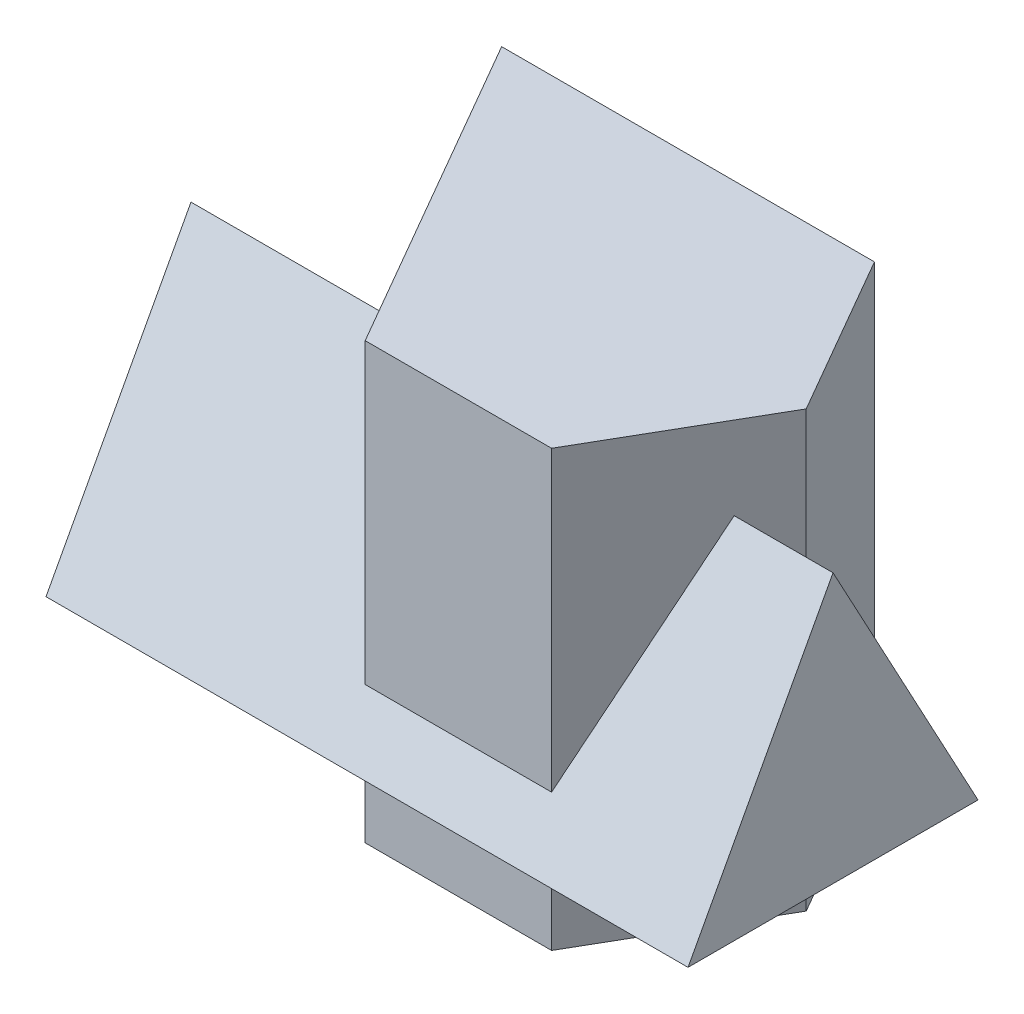
ISO-10303-21;
HEADER;
FILE_DESCRIPTION(('STEP AP214'),'2;1');
FILE_NAME('part.step','',(''),(''),'','','');
FILE_SCHEMA(('AUTOMOTIVE_DESIGN { 1 0 10303 214 1 1 1 1 }'));
ENDSEC;
DATA;
#1=APPLICATION_CONTEXT('core data for automotive mechanical design processes');
#2=APPLICATION_PROTOCOL_DEFINITION('international standard','automotive_design',2000,#1);
#3=PRODUCT_CONTEXT('',#1,'mechanical');
#4=PRODUCT('Part','Part','',(#3));
#5=PRODUCT_RELATED_PRODUCT_CATEGORY('part','',(#4));
#6=PRODUCT_DEFINITION_FORMATION('','',#4);
#7=PRODUCT_DEFINITION_CONTEXT('part definition',#1,'design');
#8=PRODUCT_DEFINITION('design','',#6,#7);
#9=PRODUCT_DEFINITION_SHAPE('','',#8);
#10=(LENGTH_UNIT() NAMED_UNIT(*) SI_UNIT(.MILLI.,.METRE.));
#11=(NAMED_UNIT(*) PLANE_ANGLE_UNIT() SI_UNIT($,.RADIAN.));
#12=(NAMED_UNIT(*) SI_UNIT($,.STERADIAN.) SOLID_ANGLE_UNIT());
#13=UNCERTAINTY_MEASURE_WITH_UNIT(LENGTH_MEASURE(1.E-05),#10,'distance_accuracy_value','');
#14=(GEOMETRIC_REPRESENTATION_CONTEXT(3) GLOBAL_UNCERTAINTY_ASSIGNED_CONTEXT((#13)) GLOBAL_UNIT_ASSIGNED_CONTEXT((#10,
#11,#12)) REPRESENTATION_CONTEXT('',''));
#15=CARTESIAN_POINT('',(0.,0.,0.));
#16=DIRECTION('',(0.,0.,1.));
#17=DIRECTION('',(1.,0.,0.));
#18=AXIS2_PLACEMENT_3D('',#15,#16,#17);
#19=CARTESIAN_POINT('',(-92.5,85.,11.0288568297002));
#20=DIRECTION('',(0.,0.474099823035017,-0.880471099922175));
#21=DIRECTION('',(0.,0.880471099922175,0.474099823035017));
#22=AXIS2_PLACEMENT_3D('',#19,#20,#21);
#23=PLANE('',#22);
#24=DIRECTION('',(0.,0.880471099922175,0.474099823035017));
#25=VECTOR('',#24,1.);
#26=CARTESIAN_POINT('',(62.5,85.,11.0288568297002));
#27=LINE('',#26,#25);
#28=CARTESIAN_POINT('',(62.5,20.,-23.9711431702998));
#29=VERTEX_POINT('',#28);
#30=CARTESIAN_POINT('',(62.5,85.,11.0288568297002));
#31=VERTEX_POINT('',#30);
#32=EDGE_CURVE('E76',#29,#31,#27,.T.);
#33=ORIENTED_EDGE('',*,*,#32,.F.);
#34=DIRECTION('',(1.,0.,0.));
#35=VECTOR('',#34,1.);
#36=CARTESIAN_POINT('',(-92.5,20.,-23.9711431702998));
#37=LINE('',#36,#35);
#38=CARTESIAN_POINT('',(-92.5,20.,-23.9711431702998));
#39=VERTEX_POINT('',#38);
#40=EDGE_CURVE('E12',#39,#29,#37,.T.);
#41=ORIENTED_EDGE('',*,*,#40,.F.);
#42=DIRECTION('',(0.,0.880471099922175,0.474099823035017));
#43=VECTOR('',#42,1.);
#44=CARTESIAN_POINT('',(-92.5,85.,11.0288568297002));
#45=LINE('',#44,#43);
#46=CARTESIAN_POINT('',(-92.5,85.,11.0288568297002));
#47=VERTEX_POINT('',#46);
#48=EDGE_CURVE('E78',#39,#47,#45,.T.);
#49=ORIENTED_EDGE('',*,*,#48,.T.);
#50=DIRECTION('',(1.,0.,0.));
#51=VECTOR('',#50,1.);
#52=CARTESIAN_POINT('',(-92.5,85.,11.0288568297002));
#53=LINE('',#52,#51);
#54=EDGE_CURVE('E45',#47,#31,#53,.T.);
#55=ORIENTED_EDGE('',*,*,#54,.T.);
#56=EDGE_LOOP('',(#33,#41,#49,#55));
#57=FACE_BOUND('',#56,.T.);
#58=ADVANCED_FACE('F42',(#57),#23,.T.);
#59=CARTESIAN_POINT('',(-92.5,20.,46.0288568297002));
#60=DIRECTION('',(0.,-1.,0.));
#61=DIRECTION('',(0.,0.,-1.));
#62=AXIS2_PLACEMENT_3D('',#59,#60,#61);
#63=PLANE('',#62);
#64=DIRECTION('',(0.,0.,-1.));
#65=VECTOR('',#64,1.);
#66=CARTESIAN_POINT('',(62.5,20.,46.0288568297002));
#67=LINE('',#66,#65);
#68=CARTESIAN_POINT('',(62.5,20.,46.0288568297002));
#69=VERTEX_POINT('',#68);
#70=EDGE_CURVE('E86',#69,#29,#67,.T.);
#71=ORIENTED_EDGE('',*,*,#70,.F.);
#72=DIRECTION('',(1.,0.,0.));
#73=VECTOR('',#72,1.);
#74=CARTESIAN_POINT('',(-92.5,20.,46.0288568297002));
#75=LINE('',#74,#73);
#76=CARTESIAN_POINT('',(-92.5,20.,46.0288568297002));
#77=VERTEX_POINT('',#76);
#78=EDGE_CURVE('E50',#77,#69,#75,.T.);
#79=ORIENTED_EDGE('',*,*,#78,.F.);
#80=DIRECTION('',(0.,0.,-1.));
#81=VECTOR('',#80,1.);
#82=CARTESIAN_POINT('',(-92.5,20.,46.0288568297002));
#83=LINE('',#82,#81);
#84=EDGE_CURVE('E81',#77,#39,#83,.T.);
#85=ORIENTED_EDGE('',*,*,#84,.T.);
#86=ORIENTED_EDGE('',*,*,#40,.T.);
#87=EDGE_LOOP('',(#71,#79,#85,#86));
#88=FACE_BOUND('',#87,.T.);
#89=ADVANCED_FACE('F96',(#88),#63,.T.);
#90=CARTESIAN_POINT('',(-92.5,20.,46.0288568297002));
#91=DIRECTION('',(0.,0.474099823035017,0.880471099922175));
#92=DIRECTION('',(0.,-0.880471099922175,0.474099823035017));
#93=AXIS2_PLACEMENT_3D('',#90,#91,#92);
#94=PLANE('',#93);
#95=DIRECTION('',(0.,-0.880471099922175,0.474099823035017));
#96=VECTOR('',#95,1.);
#97=CARTESIAN_POINT('',(62.5,20.,46.0288568297002));
#98=LINE('',#97,#96);
#99=EDGE_CURVE('E83',#31,#69,#98,.T.);
#100=ORIENTED_EDGE('',*,*,#99,.F.);
#101=ORIENTED_EDGE('',*,*,#54,.F.);
#102=DIRECTION('',(0.,-0.880471099922175,0.474099823035017));
#103=VECTOR('',#102,1.);
#104=CARTESIAN_POINT('',(-92.5,20.,46.0288568297002));
#105=LINE('',#104,#103);
#106=EDGE_CURVE('E93',#47,#77,#105,.T.);
#107=ORIENTED_EDGE('',*,*,#106,.T.);
#108=ORIENTED_EDGE('',*,*,#78,.T.);
#109=EDGE_LOOP('',(#100,#101,#107,#108));
#110=FACE_BOUND('',#109,.T.);
#111=ADVANCED_FACE('F84',(#110),#94,.T.);
#112=CARTESIAN_POINT('',(-92.5,20.,-23.9711431702998));
#113=DIRECTION('',(1.,0.,0.));
#114=DIRECTION('',(0.,0.,-1.));
#115=AXIS2_PLACEMENT_3D('',#112,#113,#114);
#116=PLANE('',#115);
#117=ORIENTED_EDGE('',*,*,#48,.F.);
#118=ORIENTED_EDGE('',*,*,#84,.F.);
#119=ORIENTED_EDGE('',*,*,#106,.F.);
#120=EDGE_LOOP('',(#117,#118,#119));
#121=FACE_BOUND('',#120,.T.);
#122=ADVANCED_FACE('F98',(#121),#116,.F.);
#123=CARTESIAN_POINT('',(62.5,20.,-23.9711431702998));
#124=DIRECTION('',(1.,0.,0.));
#125=DIRECTION('',(0.,0.,-1.));
#126=AXIS2_PLACEMENT_3D('',#123,#124,#125);
#127=PLANE('',#126);
#128=ORIENTED_EDGE('',*,*,#32,.T.);
#129=ORIENTED_EDGE('',*,*,#99,.T.);
#130=ORIENTED_EDGE('',*,*,#70,.T.);
#131=EDGE_LOOP('',(#128,#129,#130));
#132=FACE_BOUND('',#131,.T.);
#133=ADVANCED_FACE('F88',(#132),#127,.T.);
#134=CLOSED_SHELL('',(#58,#89,#111,#122,#133));
#135=MANIFOLD_SOLID_BREP('B2',#134);
#136=CARTESIAN_POINT('',(22.5000000000005,105.,38.9711431702995));
#137=DIRECTION('',(-0.866025403784442,0.,-0.499999999999995));
#138=DIRECTION('',(-0.499999999999995,0.,0.866025403784442));
#139=AXIS2_PLACEMENT_3D('',#136,#137,#138);
#140=PLANE('',#139);
#141=DIRECTION('',(0.499999999999995,0.,-0.866025403784442));
#142=VECTOR('',#141,1.);
#143=CARTESIAN_POINT('',(22.5000000000005,0.,38.9711431702995));
#144=LINE('',#143,#142);
#145=CARTESIAN_POINT('',(22.5000000000005,0.,38.9711431702995));
#146=VERTEX_POINT('',#145);
#147=CARTESIAN_POINT('',(45.,0.,0.));
#148=VERTEX_POINT('',#147);
#149=EDGE_CURVE('E189',#146,#148,#144,.T.);
#150=ORIENTED_EDGE('',*,*,#149,.T.);
#151=DIRECTION('',(0.,-1.,0.));
#152=VECTOR('',#151,1.);
#153=CARTESIAN_POINT('',(45.,105.,0.));
#154=LINE('',#153,#152);
#155=CARTESIAN_POINT('',(45.,105.,0.));
#156=VERTEX_POINT('',#155);
#157=EDGE_CURVE('E40',#156,#148,#154,.T.);
#158=ORIENTED_EDGE('',*,*,#157,.F.);
#159=DIRECTION('',(0.499999999999995,0.,-0.866025403784442));
#160=VECTOR('',#159,1.);
#161=CARTESIAN_POINT('',(22.5000000000005,105.,38.9711431702995));
#162=LINE('',#161,#160);
#163=CARTESIAN_POINT('',(22.5000000000005,105.,38.9711431702995));
#164=VERTEX_POINT('',#163);
#165=EDGE_CURVE('E210',#164,#156,#162,.T.);
#166=ORIENTED_EDGE('',*,*,#165,.F.);
#167=DIRECTION('',(0.,-1.,0.));
#168=VECTOR('',#167,1.);
#169=CARTESIAN_POINT('',(22.5000000000005,105.,38.9711431702995));
#170=LINE('',#169,#168);
#171=EDGE_CURVE('E202',#164,#146,#170,.T.);
#172=ORIENTED_EDGE('',*,*,#171,.T.);
#173=EDGE_LOOP('',(#150,#158,#166,#172));
#174=FACE_BOUND('',#173,.T.);
#175=ADVANCED_FACE('F139',(#174),#140,.F.);
#176=CARTESIAN_POINT('',(45.,105.,0.));
#177=DIRECTION('',(-0.866025403784438,0.,0.500000000000001));
#178=DIRECTION('',(0.500000000000001,0.,0.866025403784438));
#179=AXIS2_PLACEMENT_3D('',#176,#177,#178);
#180=PLANE('',#179);
#181=DIRECTION('',(-0.500000000000001,0.,-0.866025403784438));
#182=VECTOR('',#181,1.);
#183=CARTESIAN_POINT('',(45.,0.,0.));
#184=LINE('',#183,#182);
#185=CARTESIAN_POINT('',(22.4999999999999,0.,-38.9711431702998));
#186=VERTEX_POINT('',#185);
#187=EDGE_CURVE('E185',#148,#186,#184,.T.);
#188=ORIENTED_EDGE('',*,*,#187,.T.);
#189=DIRECTION('',(0.,-1.,0.));
#190=VECTOR('',#189,1.);
#191=CARTESIAN_POINT('',(22.4999999999999,105.,-38.9711431702998));
#192=LINE('',#191,#190);
#193=CARTESIAN_POINT('',(22.4999999999999,105.,-38.9711431702998));
#194=VERTEX_POINT('',#193);
#195=EDGE_CURVE('E146',#194,#186,#192,.T.);
#196=ORIENTED_EDGE('',*,*,#195,.F.);
#197=DIRECTION('',(-0.500000000000001,0.,-0.866025403784438));
#198=VECTOR('',#197,1.);
#199=CARTESIAN_POINT('',(45.,105.,0.));
#200=LINE('',#199,#198);
#201=EDGE_CURVE('E198',#156,#194,#200,.T.);
#202=ORIENTED_EDGE('',*,*,#201,.F.);
#203=ORIENTED_EDGE('',*,*,#157,.T.);
#204=EDGE_LOOP('',(#188,#196,#202,#203));
#205=FACE_BOUND('',#204,.T.);
#206=ADVANCED_FACE('F197',(#205),#180,.F.);
#207=CARTESIAN_POINT('',(22.4999999999999,105.,-38.9711431702998));
#208=DIRECTION('',(0.,0.,1.));
#209=DIRECTION('',(1.,0.,0.));
#210=AXIS2_PLACEMENT_3D('',#207,#208,#209);
#211=PLANE('',#210);
#212=DIRECTION('',(-1.,0.,0.));
#213=VECTOR('',#212,1.);
#214=CARTESIAN_POINT('',(22.4999999999999,0.,-38.9711431702998));
#215=LINE('',#214,#213);
#216=CARTESIAN_POINT('',(-67.5000000000005,0.,-38.9711431702995));
#217=VERTEX_POINT('',#216);
#218=EDGE_CURVE('E191',#186,#217,#215,.T.);
#219=ORIENTED_EDGE('',*,*,#218,.T.);
#220=DIRECTION('',(0.,-1.,0.));
#221=VECTOR('',#220,1.);
#222=CARTESIAN_POINT('',(-67.5000000000005,105.,-38.9711431702995));
#223=LINE('',#222,#221);
#224=CARTESIAN_POINT('',(-67.5000000000005,105.,-38.9711431702995));
#225=VERTEX_POINT('',#224);
#226=EDGE_CURVE('E221',#225,#217,#223,.T.);
#227=ORIENTED_EDGE('',*,*,#226,.F.);
#228=DIRECTION('',(-1.,0.,0.));
#229=VECTOR('',#228,1.);
#230=CARTESIAN_POINT('',(22.4999999999999,105.,-38.9711431702998));
#231=LINE('',#230,#229);
#232=EDGE_CURVE('E213',#194,#225,#231,.T.);
#233=ORIENTED_EDGE('',*,*,#232,.F.);
#234=ORIENTED_EDGE('',*,*,#195,.T.);
#235=EDGE_LOOP('',(#219,#227,#233,#234));
#236=FACE_BOUND('',#235,.T.);
#237=ADVANCED_FACE('F225',(#236),#211,.F.);
#238=CARTESIAN_POINT('',(-67.5000000000005,105.,-38.9711431702995));
#239=DIRECTION('',(0.866025403784435,0.,-0.500000000000007));
#240=DIRECTION('',(-0.500000000000007,0.,-0.866025403784435));
#241=AXIS2_PLACEMENT_3D('',#238,#239,#240);
#242=PLANE('',#241);
#243=DIRECTION('',(0.500000000000007,0.,0.866025403784435));
#244=VECTOR('',#243,1.);
#245=CARTESIAN_POINT('',(-67.5000000000005,0.,-38.9711431702995));
#246=LINE('',#245,#244);
#247=CARTESIAN_POINT('',(-22.4999999999996,0.,38.9711431703));
#248=VERTEX_POINT('',#247);
#249=EDGE_CURVE('E206',#217,#248,#246,.T.);
#250=ORIENTED_EDGE('',*,*,#249,.T.);
#251=DIRECTION('',(0.,-1.,0.));
#252=VECTOR('',#251,1.);
#253=CARTESIAN_POINT('',(-22.4999999999996,105.,38.9711431703));
#254=LINE('',#253,#252);
#255=CARTESIAN_POINT('',(-22.4999999999996,105.,38.9711431703));
#256=VERTEX_POINT('',#255);
#257=EDGE_CURVE('E218',#256,#248,#254,.T.);
#258=ORIENTED_EDGE('',*,*,#257,.F.);
#259=DIRECTION('',(0.500000000000007,0.,0.866025403784435));
#260=VECTOR('',#259,1.);
#261=CARTESIAN_POINT('',(-67.5000000000005,105.,-38.9711431702995));
#262=LINE('',#261,#260);
#263=EDGE_CURVE('E158',#225,#256,#262,.T.);
#264=ORIENTED_EDGE('',*,*,#263,.F.);
#265=ORIENTED_EDGE('',*,*,#226,.T.);
#266=EDGE_LOOP('',(#250,#258,#264,#265));
#267=FACE_BOUND('',#266,.T.);
#268=ADVANCED_FACE('F236',(#267),#242,.F.);
#269=CARTESIAN_POINT('',(-22.4999999999996,105.,38.9711431703));
#270=DIRECTION('',(0.,0.,-1.));
#271=DIRECTION('',(-1.,0.,0.));
#272=AXIS2_PLACEMENT_3D('',#269,#270,#271);
#273=PLANE('',#272);
#274=DIRECTION('',(1.,0.,0.));
#275=VECTOR('',#274,1.);
#276=CARTESIAN_POINT('',(-22.4999999999996,0.,38.9711431703));
#277=LINE('',#276,#275);
#278=EDGE_CURVE('E208',#248,#146,#277,.T.);
#279=ORIENTED_EDGE('',*,*,#278,.T.);
#280=ORIENTED_EDGE('',*,*,#171,.F.);
#281=DIRECTION('',(1.,0.,0.));
#282=VECTOR('',#281,1.);
#283=CARTESIAN_POINT('',(-22.4999999999996,105.,38.9711431703));
#284=LINE('',#283,#282);
#285=EDGE_CURVE('E153',#256,#164,#284,.T.);
#286=ORIENTED_EDGE('',*,*,#285,.F.);
#287=ORIENTED_EDGE('',*,*,#257,.T.);
#288=EDGE_LOOP('',(#279,#280,#286,#287));
#289=FACE_BOUND('',#288,.T.);
#290=ADVANCED_FACE('F229',(#289),#273,.F.);
#291=CARTESIAN_POINT('',(67.4999999999998,105.,-38.9711431702999));
#292=DIRECTION('',(0.,1.,0.));
#293=DIRECTION('',(0.,0.,1.));
#294=AXIS2_PLACEMENT_3D('',#291,#292,#293);
#295=PLANE('',#294);
#296=ORIENTED_EDGE('',*,*,#165,.T.);
#297=ORIENTED_EDGE('',*,*,#201,.T.);
#298=ORIENTED_EDGE('',*,*,#232,.T.);
#299=ORIENTED_EDGE('',*,*,#263,.T.);
#300=ORIENTED_EDGE('',*,*,#285,.T.);
#301=EDGE_LOOP('',(#296,#297,#298,#299,#300));
#302=FACE_BOUND('',#301,.T.);
#303=ADVANCED_FACE('F227',(#302),#295,.T.);
#304=CARTESIAN_POINT('',(67.4999999999998,0.,-38.9711431702999));
#305=DIRECTION('',(0.,1.,0.));
#306=DIRECTION('',(0.,0.,1.));
#307=AXIS2_PLACEMENT_3D('',#304,#305,#306);
#308=PLANE('',#307);
#309=ORIENTED_EDGE('',*,*,#149,.F.);
#310=ORIENTED_EDGE('',*,*,#278,.F.);
#311=ORIENTED_EDGE('',*,*,#249,.F.);
#312=ORIENTED_EDGE('',*,*,#218,.F.);
#313=ORIENTED_EDGE('',*,*,#187,.F.);
#314=EDGE_LOOP('',(#309,#310,#311,#312,#313));
#315=FACE_BOUND('',#314,.T.);
#316=ADVANCED_FACE('F186',(#315),#308,.F.);
#317=CLOSED_SHELL('',(#175,#206,#237,#268,#290,#303,#316));
#318=MANIFOLD_SOLID_BREP('B6',#317);
#319=ADVANCED_BREP_SHAPE_REPRESENTATION('',(#18,#135,#318),#14);
#320=SHAPE_DEFINITION_REPRESENTATION(#9,#319);
ENDSEC;
END-ISO-10303-21;
